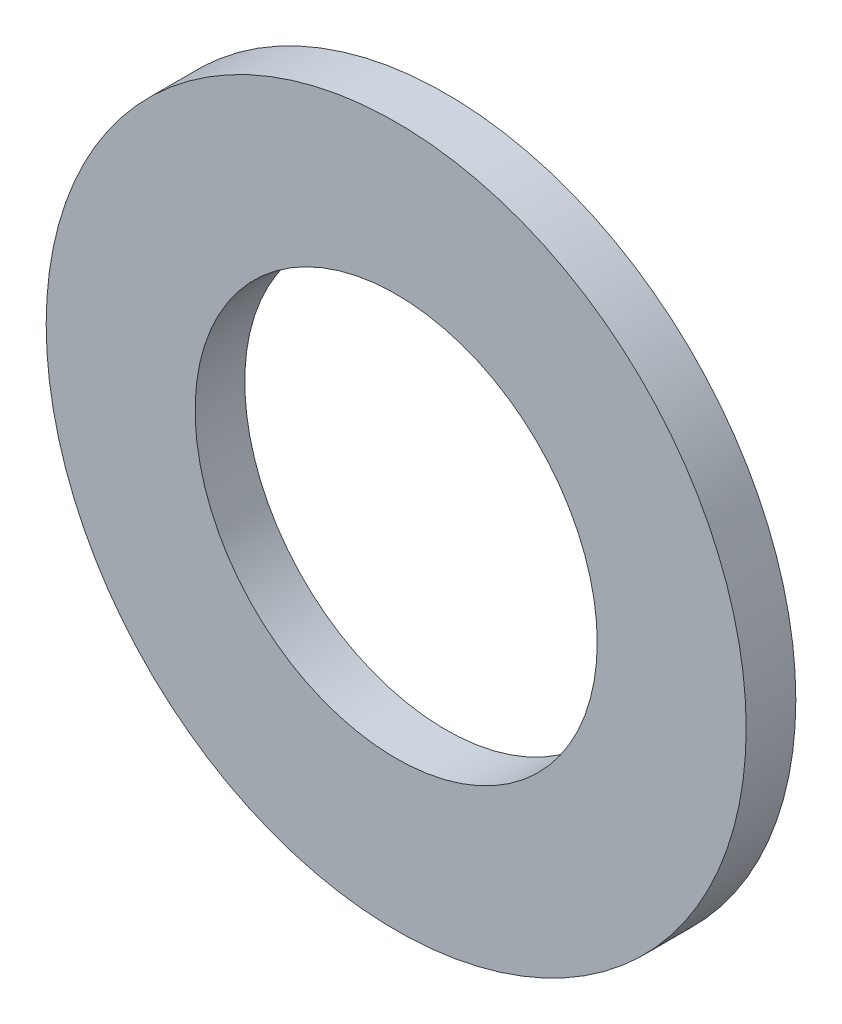
ISO-10303-21;
HEADER;
FILE_DESCRIPTION(('STEP AP214'),'2;1');
FILE_NAME('part.step','',(''),(''),'','','');
FILE_SCHEMA(('AUTOMOTIVE_DESIGN { 1 0 10303 214 1 1 1 1 }'));
ENDSEC;
DATA;
#1=APPLICATION_CONTEXT('core data for automotive mechanical design processes');
#2=APPLICATION_PROTOCOL_DEFINITION('international standard','automotive_design',2000,#1);
#3=PRODUCT_CONTEXT('',#1,'mechanical');
#4=PRODUCT('Part','Part','',(#3));
#5=PRODUCT_RELATED_PRODUCT_CATEGORY('part','',(#4));
#6=PRODUCT_DEFINITION_FORMATION('','',#4);
#7=PRODUCT_DEFINITION_CONTEXT('part definition',#1,'design');
#8=PRODUCT_DEFINITION('design','',#6,#7);
#9=PRODUCT_DEFINITION_SHAPE('','',#8);
#10=(LENGTH_UNIT() NAMED_UNIT(*) SI_UNIT(.MILLI.,.METRE.));
#11=(NAMED_UNIT(*) PLANE_ANGLE_UNIT() SI_UNIT($,.RADIAN.));
#12=(NAMED_UNIT(*) SI_UNIT($,.STERADIAN.) SOLID_ANGLE_UNIT());
#13=UNCERTAINTY_MEASURE_WITH_UNIT(LENGTH_MEASURE(1.E-05),#10,'distance_accuracy_value','');
#14=(GEOMETRIC_REPRESENTATION_CONTEXT(3) GLOBAL_UNCERTAINTY_ASSIGNED_CONTEXT((#13)) GLOBAL_UNIT_ASSIGNED_CONTEXT((#10,
#11,#12)) REPRESENTATION_CONTEXT('',''));
#15=CARTESIAN_POINT('',(0.,0.,0.));
#16=DIRECTION('',(0.,0.,1.));
#17=DIRECTION('',(1.,0.,0.));
#18=AXIS2_PLACEMENT_3D('',#15,#16,#17);
#19=CARTESIAN_POINT('',(0.,0.,1.));
#20=DIRECTION('',(0.,0.,1.));
#21=DIRECTION('',(1.,0.,0.));
#22=AXIS2_PLACEMENT_3D('',#19,#20,#21);
#23=PLANE('',#22);
#24=CARTESIAN_POINT('',(0.,0.,1.));
#25=DIRECTION('',(0.,0.,1.));
#26=DIRECTION('',(1.,0.,0.));
#27=AXIS2_PLACEMENT_3D('',#24,#25,#26);
#28=CIRCLE('',#27,7.05);
#29=CARTESIAN_POINT('',(7.05,0.,1.));
#30=VERTEX_POINT('',#29);
#31=EDGE_CURVE('E10',#30,#30,#28,.T.);
#32=ORIENTED_EDGE('',*,*,#31,.T.);
#33=EDGE_LOOP('',(#32));
#34=FACE_BOUND('',#33,.T.);
#35=CARTESIAN_POINT('',(0.,0.,1.));
#36=DIRECTION('',(0.,0.,1.));
#37=DIRECTION('',(1.,0.,0.));
#38=AXIS2_PLACEMENT_3D('',#35,#36,#37);
#39=CIRCLE('',#38,4.05);
#40=CARTESIAN_POINT('',(4.05,0.,1.));
#41=VERTEX_POINT('',#40);
#42=EDGE_CURVE('E50',#41,#41,#39,.T.);
#43=ORIENTED_EDGE('',*,*,#42,.F.);
#44=EDGE_LOOP('',(#43));
#45=FACE_BOUND('',#44,.T.);
#46=ADVANCED_FACE('F39',(#34,#45),#23,.T.);
#47=CARTESIAN_POINT('',(0.,0.,0.));
#48=DIRECTION('',(0.,0.,1.));
#49=DIRECTION('',(1.,0.,0.));
#50=AXIS2_PLACEMENT_3D('',#47,#48,#49);
#51=PLANE('',#50);
#52=CARTESIAN_POINT('',(0.,0.,0.));
#53=DIRECTION('',(0.,0.,1.));
#54=DIRECTION('',(1.,0.,0.));
#55=AXIS2_PLACEMENT_3D('',#52,#53,#54);
#56=CIRCLE('',#55,7.05);
#57=CARTESIAN_POINT('',(7.05,0.,0.));
#58=VERTEX_POINT('',#57);
#59=EDGE_CURVE('E43',#58,#58,#56,.T.);
#60=ORIENTED_EDGE('',*,*,#59,.F.);
#61=EDGE_LOOP('',(#60));
#62=FACE_BOUND('',#61,.T.);
#63=CARTESIAN_POINT('',(0.,0.,0.));
#64=DIRECTION('',(0.,0.,1.));
#65=DIRECTION('',(1.,0.,0.));
#66=AXIS2_PLACEMENT_3D('',#63,#64,#65);
#67=CIRCLE('',#66,4.05);
#68=CARTESIAN_POINT('',(4.05,0.,0.));
#69=VERTEX_POINT('',#68);
#70=EDGE_CURVE('E52',#69,#69,#67,.T.);
#71=ORIENTED_EDGE('',*,*,#70,.T.);
#72=EDGE_LOOP('',(#71));
#73=FACE_BOUND('',#72,.T.);
#74=ADVANCED_FACE('F62',(#62,#73),#51,.F.);
#75=CARTESIAN_POINT('',(0.,0.,1.));
#76=DIRECTION('',(0.,0.,-1.));
#77=DIRECTION('',(-1.,0.,0.));
#78=AXIS2_PLACEMENT_3D('',#75,#76,#77);
#79=CYLINDRICAL_SURFACE('',#78,7.05);
#80=ORIENTED_EDGE('',*,*,#31,.F.);
#81=EDGE_LOOP('',(#80));
#82=FACE_BOUND('',#81,.T.);
#83=ORIENTED_EDGE('',*,*,#59,.T.);
#84=EDGE_LOOP('',(#83));
#85=FACE_BOUND('',#84,.T.);
#86=ADVANCED_FACE('F41',(#82,#85),#79,.T.);
#87=CARTESIAN_POINT('',(0.,0.,1.));
#88=DIRECTION('',(0.,0.,-1.));
#89=DIRECTION('',(-1.,0.,0.));
#90=AXIS2_PLACEMENT_3D('',#87,#88,#89);
#91=CYLINDRICAL_SURFACE('',#90,4.05);
#92=ORIENTED_EDGE('',*,*,#42,.T.);
#93=EDGE_LOOP('',(#92));
#94=FACE_BOUND('',#93,.T.);
#95=ORIENTED_EDGE('',*,*,#70,.F.);
#96=EDGE_LOOP('',(#95));
#97=FACE_BOUND('',#96,.T.);
#98=ADVANCED_FACE('F58',(#94,#97),#91,.F.);
#99=CLOSED_SHELL('',(#46,#74,#86,#98));
#100=MANIFOLD_SOLID_BREP('B2',#99);
#101=ADVANCED_BREP_SHAPE_REPRESENTATION('',(#18,#100),#14);
#102=SHAPE_DEFINITION_REPRESENTATION(#9,#101);
ENDSEC;
END-ISO-10303-21;
